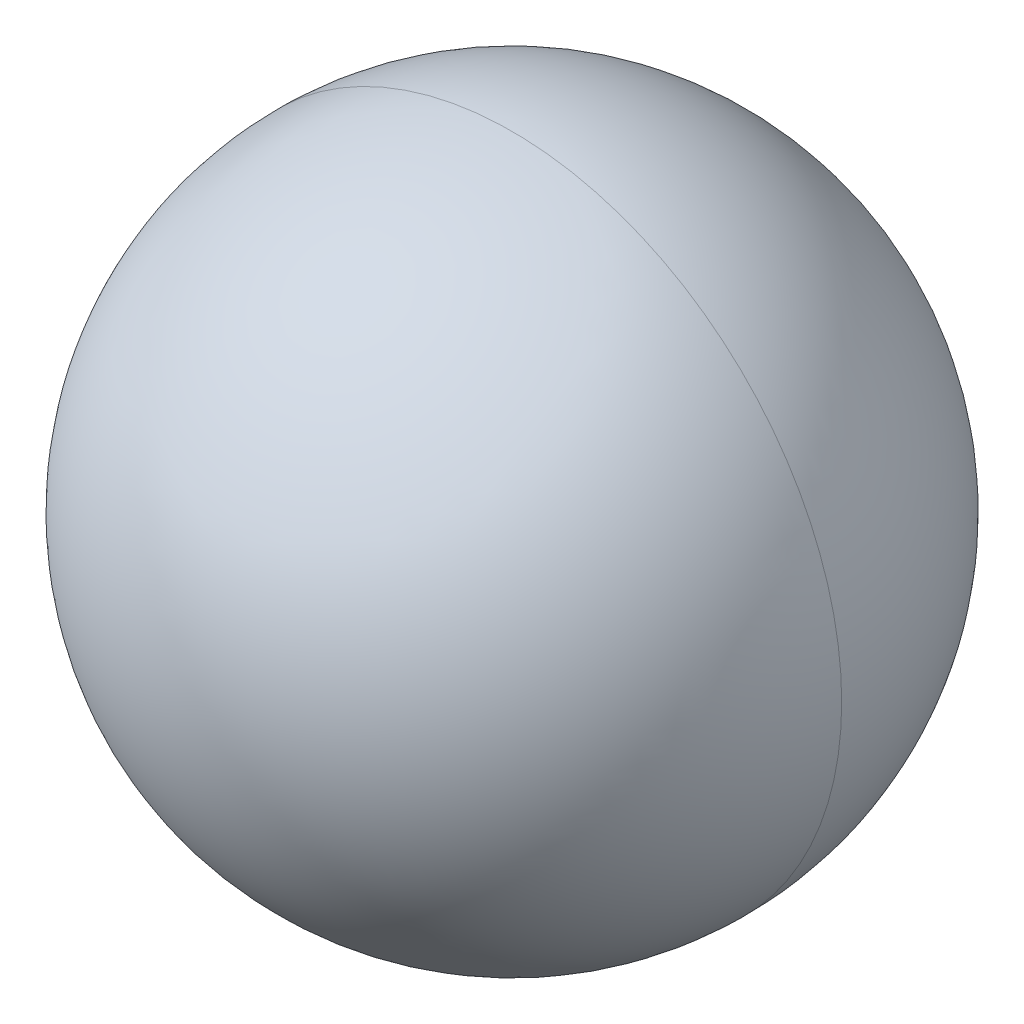
ISO-10303-21;
HEADER;
FILE_DESCRIPTION(('STEP AP214'),'2;1');
FILE_NAME('part.step','',(''),(''),'','','');
FILE_SCHEMA(('AUTOMOTIVE_DESIGN { 1 0 10303 214 1 1 1 1 }'));
ENDSEC;
DATA;
#1=APPLICATION_CONTEXT('core data for automotive mechanical design processes');
#2=APPLICATION_PROTOCOL_DEFINITION('international standard','automotive_design',2000,#1);
#3=PRODUCT_CONTEXT('',#1,'mechanical');
#4=PRODUCT('Part','Part','',(#3));
#5=PRODUCT_RELATED_PRODUCT_CATEGORY('part','',(#4));
#6=PRODUCT_DEFINITION_FORMATION('','',#4);
#7=PRODUCT_DEFINITION_CONTEXT('part definition',#1,'design');
#8=PRODUCT_DEFINITION('design','',#6,#7);
#9=PRODUCT_DEFINITION_SHAPE('','',#8);
#10=(LENGTH_UNIT() NAMED_UNIT(*) SI_UNIT(.MILLI.,.METRE.));
#11=(NAMED_UNIT(*) PLANE_ANGLE_UNIT() SI_UNIT($,.RADIAN.));
#12=(NAMED_UNIT(*) SI_UNIT($,.STERADIAN.) SOLID_ANGLE_UNIT());
#13=UNCERTAINTY_MEASURE_WITH_UNIT(LENGTH_MEASURE(1.E-05),#10,'distance_accuracy_value','');
#14=(GEOMETRIC_REPRESENTATION_CONTEXT(3) GLOBAL_UNCERTAINTY_ASSIGNED_CONTEXT((#13)) GLOBAL_UNIT_ASSIGNED_CONTEXT((#10,
#11,#12)) REPRESENTATION_CONTEXT('',''));
#15=CARTESIAN_POINT('',(0.,0.,0.));
#16=DIRECTION('',(0.,0.,1.));
#17=DIRECTION('',(1.,0.,0.));
#18=AXIS2_PLACEMENT_3D('',#15,#16,#17);
#19=CARTESIAN_POINT('',(6.,18.,0.));
#20=DIRECTION('',(1.,0.,0.));
#21=DIRECTION('',(0.,0.,-1.));
#22=AXIS2_PLACEMENT_3D('',#19,#20,#21);
#23=SPHERICAL_SURFACE('',#22,3.3735);
#24=CARTESIAN_POINT('',(6.,18.,0.));
#25=DIRECTION('',(0.,0.,1.));
#26=DIRECTION('',(1.,0.,0.));
#27=AXIS2_PLACEMENT_3D('',#24,#25,#26);
#28=CIRCLE('',#27,3.3735);
#29=CARTESIAN_POINT('',(9.3735,18.,0.));
#30=VERTEX_POINT('',#29);
#31=CARTESIAN_POINT('',(2.6265,18.,0.));
#32=VERTEX_POINT('',#31);
#33=EDGE_CURVE('E11',#30,#32,#28,.T.);
#34=ORIENTED_EDGE('',*,*,#33,.T.);
#35=CARTESIAN_POINT('',(6.,18.,0.));
#36=DIRECTION('',(0.,0.,-1.));
#37=DIRECTION('',(1.,0.,0.));
#38=AXIS2_PLACEMENT_3D('',#35,#36,#37);
#39=CIRCLE('',#38,3.3735);
#40=EDGE_CURVE('E25',#30,#32,#39,.T.);
#41=ORIENTED_EDGE('',*,*,#40,.F.);
#42=EDGE_LOOP('',(#34,#41));
#43=FACE_BOUND('',#42,.T.);
#44=ADVANCED_FACE('F17',(#43),#23,.T.);
#45=CARTESIAN_POINT('',(6.,18.,0.));
#46=DIRECTION('',(1.,0.,0.));
#47=DIRECTION('',(0.,0.,1.));
#48=AXIS2_PLACEMENT_3D('',#45,#46,#47);
#49=SPHERICAL_SURFACE('',#48,3.3735);
#50=ORIENTED_EDGE('',*,*,#33,.F.);
#51=ORIENTED_EDGE('',*,*,#40,.T.);
#52=EDGE_LOOP('',(#50,#51));
#53=FACE_BOUND('',#52,.T.);
#54=ADVANCED_FACE('F33',(#53),#49,.T.);
#55=CLOSED_SHELL('',(#44,#54));
#56=MANIFOLD_SOLID_BREP('B1',#55);
#57=ADVANCED_BREP_SHAPE_REPRESENTATION('',(#18,#56),#14);
#58=SHAPE_DEFINITION_REPRESENTATION(#9,#57);
ENDSEC;
END-ISO-10303-21;
